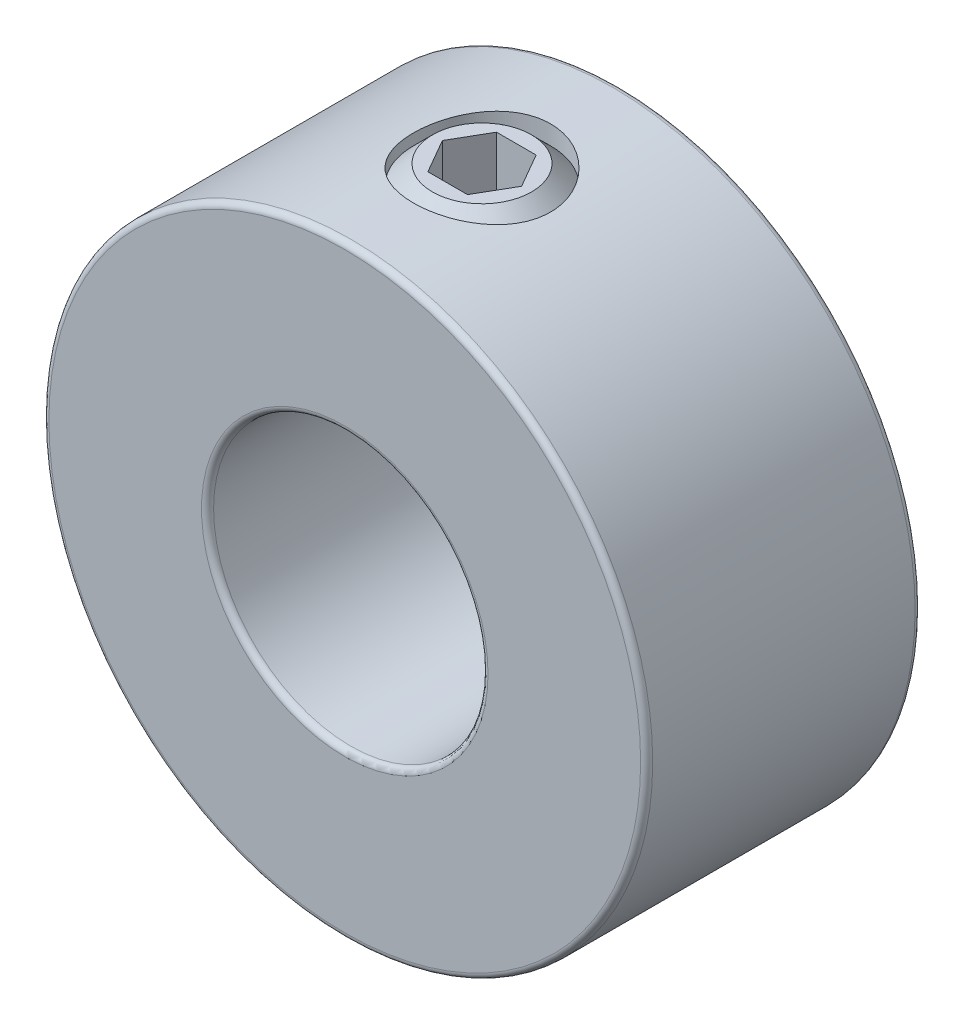
ISO-10303-21;
HEADER;
FILE_DESCRIPTION(('STEP AP214'),'2;1');
FILE_NAME('part.step','',(''),(''),'','','');
FILE_SCHEMA(('AUTOMOTIVE_DESIGN { 1 0 10303 214 1 1 1 1 }'));
ENDSEC;
DATA;
#1=APPLICATION_CONTEXT('core data for automotive mechanical design processes');
#2=APPLICATION_PROTOCOL_DEFINITION('international standard','automotive_design',2000,#1);
#3=PRODUCT_CONTEXT('',#1,'mechanical');
#4=PRODUCT('Part','Part','',(#3));
#5=PRODUCT_RELATED_PRODUCT_CATEGORY('part','',(#4));
#6=PRODUCT_DEFINITION_FORMATION('','',#4);
#7=PRODUCT_DEFINITION_CONTEXT('part definition',#1,'design');
#8=PRODUCT_DEFINITION('design','',#6,#7);
#9=PRODUCT_DEFINITION_SHAPE('','',#8);
#10=(LENGTH_UNIT() NAMED_UNIT(*) SI_UNIT(.MILLI.,.METRE.));
#11=(NAMED_UNIT(*) PLANE_ANGLE_UNIT() SI_UNIT($,.RADIAN.));
#12=(NAMED_UNIT(*) SI_UNIT($,.STERADIAN.) SOLID_ANGLE_UNIT());
#13=UNCERTAINTY_MEASURE_WITH_UNIT(LENGTH_MEASURE(1.E-05),#10,'distance_accuracy_value','');
#14=(GEOMETRIC_REPRESENTATION_CONTEXT(3) GLOBAL_UNCERTAINTY_ASSIGNED_CONTEXT((#13)) GLOBAL_UNIT_ASSIGNED_CONTEXT((#10,
#11,#12)) REPRESENTATION_CONTEXT('',''));
#15=CARTESIAN_POINT('',(0.,0.,0.));
#16=DIRECTION('',(0.,0.,1.));
#17=DIRECTION('',(1.,0.,0.));
#18=AXIS2_PLACEMENT_3D('',#15,#16,#17);
#19=CARTESIAN_POINT('',(0.,6.69578040878242,5.));
#20=DIRECTION('',(0.,1.,0.));
#21=DIRECTION('',(-1.,0.,0.));
#22=AXIS2_PLACEMENT_3D('',#19,#20,#21);
#23=CONICAL_SURFACE('',#22,2.5,0.785398163397447);
#24=CARTESIAN_POINT('',(0.,6.,5.));
#25=DIRECTION('',(0.,-1.,0.));
#26=DIRECTION('',(1.,0.,0.));
#27=AXIS2_PLACEMENT_3D('',#24,#25,#26);
#28=CIRCLE('',#27,1.80421959121758);
#29=CARTESIAN_POINT('',(1.80421959121758,6.,5.));
#30=VERTEX_POINT('',#29);
#31=EDGE_CURVE('E12',#30,#30,#28,.T.);
#32=ORIENTED_EDGE('',*,*,#31,.F.);
#33=EDGE_LOOP('',(#32));
#34=FACE_BOUND('',#33,.T.);
#35=CARTESIAN_POINT('',(0.,6.69578040878242,5.));
#36=DIRECTION('',(0.,-1.,0.));
#37=DIRECTION('',(1.,0.,0.));
#38=AXIS2_PLACEMENT_3D('',#35,#36,#37);
#39=CIRCLE('',#38,2.5);
#40=CARTESIAN_POINT('',(2.5,6.69578040878242,5.));
#41=VERTEX_POINT('',#40);
#42=EDGE_CURVE('E146',#41,#41,#39,.T.);
#43=ORIENTED_EDGE('',*,*,#42,.T.);
#44=EDGE_LOOP('',(#43));
#45=FACE_BOUND('',#44,.T.);
#46=ADVANCED_FACE('F47',(#34,#45),#23,.T.);
#47=CARTESIAN_POINT('',(-0.625,6.,5.));
#48=DIRECTION('',(0.,1.,0.));
#49=DIRECTION('',(-1.,0.,0.));
#50=AXIS2_PLACEMENT_3D('',#47,#48,#49);
#51=PLANE('',#50);
#52=CARTESIAN_POINT('',(0.,6.,5.));
#53=DIRECTION('',(0.,-1.,0.));
#54=DIRECTION('',(1.,0.,0.));
#55=AXIS2_PLACEMENT_3D('',#52,#53,#54);
#56=CIRCLE('',#55,0.625);
#57=CARTESIAN_POINT('',(0.625,6.,5.));
#58=VERTEX_POINT('',#57);
#59=EDGE_CURVE('E54',#58,#58,#56,.T.);
#60=ORIENTED_EDGE('',*,*,#59,.F.);
#61=EDGE_LOOP('',(#60));
#62=FACE_BOUND('',#61,.T.);
#63=ORIENTED_EDGE('',*,*,#31,.T.);
#64=EDGE_LOOP('',(#63));
#65=FACE_BOUND('',#64,.T.);
#66=ADVANCED_FACE('F166',(#62,#65),#51,.F.);
#67=CARTESIAN_POINT('',(0.,6.,5.));
#68=DIRECTION('',(0.,-1.,0.));
#69=DIRECTION('',(1.,0.,0.));
#70=AXIS2_PLACEMENT_3D('',#67,#68,#69);
#71=CONICAL_SURFACE('',#70,0.625,0.523598775598296);
#72=CARTESIAN_POINT('',(0.,7.08253175473055,5.));
#73=VERTEX_POINT('',#72);
#74=VERTEX_LOOP('',#73);
#75=FACE_BOUND('',#74,.T.);
#76=ORIENTED_EDGE('',*,*,#59,.T.);
#77=EDGE_LOOP('',(#76));
#78=FACE_BOUND('',#77,.T.);
#79=ADVANCED_FACE('F164',(#75,#78),#71,.F.);
#80=CARTESIAN_POINT('',(0.,11.,5.));
#81=DIRECTION('',(0.,-1.,0.));
#82=DIRECTION('',(1.,0.,0.));
#83=AXIS2_PLACEMENT_3D('',#80,#81,#82);
#84=PLANE('',#83);
#85=DIRECTION('',(0.5,0.,0.866025403784439));
#86=VECTOR('',#85,1.);
#87=CARTESIAN_POINT('',(-1.44337567297406,11.,5.));
#88=LINE('',#87,#86);
#89=CARTESIAN_POINT('',(-1.44337567297406,11.,5.));
#90=VERTEX_POINT('',#89);
#91=CARTESIAN_POINT('',(-0.721687836487028,11.,6.25));
#92=VERTEX_POINT('',#91);
#93=EDGE_CURVE('E134',#90,#92,#88,.T.);
#94=ORIENTED_EDGE('',*,*,#93,.F.);
#95=DIRECTION('',(-0.499999999999999,0.,0.866025403784439));
#96=VECTOR('',#95,1.);
#97=CARTESIAN_POINT('',(-0.721687836487029,11.,3.75));
#98=LINE('',#97,#96);
#99=CARTESIAN_POINT('',(-0.721687836487029,11.,3.75));
#100=VERTEX_POINT('',#99);
#101=EDGE_CURVE('E61',#100,#90,#98,.T.);
#102=ORIENTED_EDGE('',*,*,#101,.F.);
#103=DIRECTION('',(-1.,0.,0.));
#104=VECTOR('',#103,1.);
#105=CARTESIAN_POINT('',(0.721687836487035,11.,3.75));
#106=LINE('',#105,#104);
#107=CARTESIAN_POINT('',(0.721687836487035,11.,3.75));
#108=VERTEX_POINT('',#107);
#109=EDGE_CURVE('E120',#108,#100,#106,.T.);
#110=ORIENTED_EDGE('',*,*,#109,.F.);
#111=DIRECTION('',(-0.5,0.,-0.866025403784439));
#112=VECTOR('',#111,1.);
#113=CARTESIAN_POINT('',(1.44337567297407,11.,5.));
#114=LINE('',#113,#112);
#115=CARTESIAN_POINT('',(1.44337567297407,11.,5.));
#116=VERTEX_POINT('',#115);
#117=EDGE_CURVE('E123',#116,#108,#114,.T.);
#118=ORIENTED_EDGE('',*,*,#117,.F.);
#119=DIRECTION('',(0.499999999999999,0.,-0.866025403784439));
#120=VECTOR('',#119,1.);
#121=CARTESIAN_POINT('',(0.721687836487035,11.,6.25));
#122=LINE('',#121,#120);
#123=CARTESIAN_POINT('',(0.721687836487035,11.,6.25));
#124=VERTEX_POINT('',#123);
#125=EDGE_CURVE('E139',#124,#116,#122,.T.);
#126=ORIENTED_EDGE('',*,*,#125,.F.);
#127=DIRECTION('',(1.,0.,0.));
#128=VECTOR('',#127,1.);
#129=CARTESIAN_POINT('',(-0.721687836487028,11.,6.25));
#130=LINE('',#129,#128);
#131=EDGE_CURVE('E136',#92,#124,#130,.T.);
#132=ORIENTED_EDGE('',*,*,#131,.F.);
#133=EDGE_LOOP('',(#94,#102,#110,#118,#126,#132));
#134=FACE_BOUND('',#133,.T.);
#135=CARTESIAN_POINT('',(0.,11.,5.));
#136=DIRECTION('',(0.,-1.,0.));
#137=DIRECTION('',(1.,0.,0.));
#138=AXIS2_PLACEMENT_3D('',#135,#136,#137);
#139=CIRCLE('',#138,1.80421959121758);
#140=CARTESIAN_POINT('',(1.80421959121758,11.,5.));
#141=VERTEX_POINT('',#140);
#142=EDGE_CURVE('E159',#141,#141,#139,.T.);
#143=ORIENTED_EDGE('',*,*,#142,.F.);
#144=EDGE_LOOP('',(#143));
#145=FACE_BOUND('',#144,.T.);
#146=ADVANCED_FACE('F184',(#134,#145),#84,.F.);
#147=CARTESIAN_POINT('',(0.,11.,5.));
#148=DIRECTION('',(0.,-1.,0.));
#149=DIRECTION('',(1.,0.,0.));
#150=AXIS2_PLACEMENT_3D('',#147,#148,#149);
#151=CONICAL_SURFACE('',#150,1.80421959121758,0.785398163397446);
#152=CARTESIAN_POINT('',(0.,10.3042195912176,5.));
#153=DIRECTION('',(0.,-1.,0.));
#154=DIRECTION('',(1.,0.,0.));
#155=AXIS2_PLACEMENT_3D('',#152,#153,#154);
#156=CIRCLE('',#155,2.5);
#157=CARTESIAN_POINT('',(2.5,10.3042195912176,5.));
#158=VERTEX_POINT('',#157);
#159=EDGE_CURVE('E156',#158,#158,#156,.T.);
#160=ORIENTED_EDGE('',*,*,#159,.F.);
#161=EDGE_LOOP('',(#160));
#162=FACE_BOUND('',#161,.T.);
#163=ORIENTED_EDGE('',*,*,#142,.T.);
#164=EDGE_LOOP('',(#163));
#165=FACE_BOUND('',#164,.T.);
#166=ADVANCED_FACE('F178',(#162,#165),#151,.T.);
#167=CARTESIAN_POINT('',(0.,7.08253175473055,5.));
#168=DIRECTION('',(0.,-1.,0.));
#169=DIRECTION('',(1.,0.,0.));
#170=AXIS2_PLACEMENT_3D('',#167,#168,#169);
#171=CYLINDRICAL_SURFACE('',#170,2.5);
#172=ORIENTED_EDGE('',*,*,#42,.F.);
#173=EDGE_LOOP('',(#172));
#174=FACE_BOUND('',#173,.T.);
#175=ORIENTED_EDGE('',*,*,#159,.T.);
#176=EDGE_LOOP('',(#175));
#177=FACE_BOUND('',#176,.T.);
#178=ADVANCED_FACE('F175',(#174,#177),#171,.T.);
#179=CARTESIAN_POINT('',(-0.721687836487029,9.,3.75));
#180=DIRECTION('',(-0.866025403784439,0.,-0.499999999999999));
#181=DIRECTION('',(-0.499999999999999,0.,0.866025403784439));
#182=AXIS2_PLACEMENT_3D('',#179,#180,#181);
#183=PLANE('',#182);
#184=ORIENTED_EDGE('',*,*,#101,.T.);
#185=DIRECTION('',(0.,1.,0.));
#186=VECTOR('',#185,1.);
#187=CARTESIAN_POINT('',(-1.44337567297406,9.,5.));
#188=LINE('',#187,#186);
#189=CARTESIAN_POINT('',(-1.44337567297406,9.,5.));
#190=VERTEX_POINT('',#189);
#191=EDGE_CURVE('E97',#190,#90,#188,.T.);
#192=ORIENTED_EDGE('',*,*,#191,.F.);
#193=DIRECTION('',(-0.499999999999999,0.,0.866025403784439));
#194=VECTOR('',#193,1.);
#195=CARTESIAN_POINT('',(-0.721687836487029,9.,3.75));
#196=LINE('',#195,#194);
#197=CARTESIAN_POINT('',(-0.721687836487029,9.,3.75));
#198=VERTEX_POINT('',#197);
#199=EDGE_CURVE('E101',#198,#190,#196,.T.);
#200=ORIENTED_EDGE('',*,*,#199,.F.);
#201=DIRECTION('',(0.,1.,0.));
#202=VECTOR('',#201,1.);
#203=CARTESIAN_POINT('',(-0.721687836487029,9.,3.75));
#204=LINE('',#203,#202);
#205=EDGE_CURVE('E144',#198,#100,#204,.T.);
#206=ORIENTED_EDGE('',*,*,#205,.T.);
#207=EDGE_LOOP('',(#184,#192,#200,#206));
#208=FACE_BOUND('',#207,.T.);
#209=ADVANCED_FACE('F99',(#208),#183,.F.);
#210=CARTESIAN_POINT('',(0.721687836487036,9.,3.75));
#211=DIRECTION('',(0.,0.,-1.));
#212=DIRECTION('',(-1.,0.,0.));
#213=AXIS2_PLACEMENT_3D('',#210,#211,#212);
#214=PLANE('',#213);
#215=ORIENTED_EDGE('',*,*,#109,.T.);
#216=ORIENTED_EDGE('',*,*,#205,.F.);
#217=DIRECTION('',(-1.,0.,0.));
#218=VECTOR('',#217,1.);
#219=CARTESIAN_POINT('',(0.721687836487036,9.,3.75));
#220=LINE('',#219,#218);
#221=CARTESIAN_POINT('',(0.721687836487036,9.,3.75));
#222=VERTEX_POINT('',#221);
#223=EDGE_CURVE('E107',#222,#198,#220,.T.);
#224=ORIENTED_EDGE('',*,*,#223,.F.);
#225=DIRECTION('',(0.,1.,0.));
#226=VECTOR('',#225,1.);
#227=CARTESIAN_POINT('',(0.721687836487036,9.,3.75));
#228=LINE('',#227,#226);
#229=EDGE_CURVE('E147',#222,#108,#228,.T.);
#230=ORIENTED_EDGE('',*,*,#229,.T.);
#231=EDGE_LOOP('',(#215,#216,#224,#230));
#232=FACE_BOUND('',#231,.T.);
#233=ADVANCED_FACE('F198',(#232),#214,.F.);
#234=CARTESIAN_POINT('',(1.44337567297407,9.,5.));
#235=DIRECTION('',(0.866025403784439,0.,-0.5));
#236=DIRECTION('',(-0.5,0.,-0.866025403784439));
#237=AXIS2_PLACEMENT_3D('',#234,#235,#236);
#238=PLANE('',#237);
#239=ORIENTED_EDGE('',*,*,#117,.T.);
#240=ORIENTED_EDGE('',*,*,#229,.F.);
#241=DIRECTION('',(-0.5,0.,-0.866025403784439));
#242=VECTOR('',#241,1.);
#243=CARTESIAN_POINT('',(1.44337567297407,9.,5.));
#244=LINE('',#243,#242);
#245=CARTESIAN_POINT('',(1.44337567297407,9.,5.));
#246=VERTEX_POINT('',#245);
#247=EDGE_CURVE('E130',#246,#222,#244,.T.);
#248=ORIENTED_EDGE('',*,*,#247,.F.);
#249=DIRECTION('',(0.,1.,0.));
#250=VECTOR('',#249,1.);
#251=CARTESIAN_POINT('',(1.44337567297407,9.,5.));
#252=LINE('',#251,#250);
#253=EDGE_CURVE('E149',#246,#116,#252,.T.);
#254=ORIENTED_EDGE('',*,*,#253,.T.);
#255=EDGE_LOOP('',(#239,#240,#248,#254));
#256=FACE_BOUND('',#255,.T.);
#257=ADVANCED_FACE('F208',(#256),#238,.F.);
#258=CARTESIAN_POINT('',(0.721687836487036,9.,6.25));
#259=DIRECTION('',(0.866025403784439,0.,0.499999999999999));
#260=DIRECTION('',(0.499999999999999,0.,-0.866025403784439));
#261=AXIS2_PLACEMENT_3D('',#258,#259,#260);
#262=PLANE('',#261);
#263=ORIENTED_EDGE('',*,*,#125,.T.);
#264=ORIENTED_EDGE('',*,*,#253,.F.);
#265=DIRECTION('',(0.499999999999999,0.,-0.866025403784439));
#266=VECTOR('',#265,1.);
#267=CARTESIAN_POINT('',(0.721687836487036,9.,6.25));
#268=LINE('',#267,#266);
#269=CARTESIAN_POINT('',(0.721687836487036,9.,6.25));
#270=VERTEX_POINT('',#269);
#271=EDGE_CURVE('E127',#270,#246,#268,.T.);
#272=ORIENTED_EDGE('',*,*,#271,.F.);
#273=DIRECTION('',(0.,1.,0.));
#274=VECTOR('',#273,1.);
#275=CARTESIAN_POINT('',(0.721687836487036,9.,6.25));
#276=LINE('',#275,#274);
#277=EDGE_CURVE('E151',#270,#124,#276,.T.);
#278=ORIENTED_EDGE('',*,*,#277,.T.);
#279=EDGE_LOOP('',(#263,#264,#272,#278));
#280=FACE_BOUND('',#279,.T.);
#281=ADVANCED_FACE('F204',(#280),#262,.F.);
#282=CARTESIAN_POINT('',(-0.721687836487028,9.,6.25));
#283=DIRECTION('',(0.,0.,1.));
#284=DIRECTION('',(1.,0.,0.));
#285=AXIS2_PLACEMENT_3D('',#282,#283,#284);
#286=PLANE('',#285);
#287=ORIENTED_EDGE('',*,*,#131,.T.);
#288=ORIENTED_EDGE('',*,*,#277,.F.);
#289=DIRECTION('',(1.,0.,0.));
#290=VECTOR('',#289,1.);
#291=CARTESIAN_POINT('',(-0.721687836487028,9.,6.25));
#292=LINE('',#291,#290);
#293=CARTESIAN_POINT('',(-0.721687836487028,9.,6.25));
#294=VERTEX_POINT('',#293);
#295=EDGE_CURVE('E115',#294,#270,#292,.T.);
#296=ORIENTED_EDGE('',*,*,#295,.F.);
#297=DIRECTION('',(0.,1.,0.));
#298=VECTOR('',#297,1.);
#299=CARTESIAN_POINT('',(-0.721687836487028,9.,6.25));
#300=LINE('',#299,#298);
#301=EDGE_CURVE('E106',#294,#92,#300,.T.);
#302=ORIENTED_EDGE('',*,*,#301,.T.);
#303=EDGE_LOOP('',(#287,#288,#296,#302));
#304=FACE_BOUND('',#303,.T.);
#305=ADVANCED_FACE('F201',(#304),#286,.F.);
#306=CARTESIAN_POINT('',(-1.44337567297406,9.,5.));
#307=DIRECTION('',(-0.866025403784439,0.,0.5));
#308=DIRECTION('',(0.5,0.,0.866025403784439));
#309=AXIS2_PLACEMENT_3D('',#306,#307,#308);
#310=PLANE('',#309);
#311=ORIENTED_EDGE('',*,*,#93,.T.);
#312=ORIENTED_EDGE('',*,*,#301,.F.);
#313=DIRECTION('',(0.5,0.,0.866025403784439));
#314=VECTOR('',#313,1.);
#315=CARTESIAN_POINT('',(-1.44337567297406,9.,5.));
#316=LINE('',#315,#314);
#317=EDGE_CURVE('E110',#190,#294,#316,.T.);
#318=ORIENTED_EDGE('',*,*,#317,.F.);
#319=ORIENTED_EDGE('',*,*,#191,.T.);
#320=EDGE_LOOP('',(#311,#312,#318,#319));
#321=FACE_BOUND('',#320,.T.);
#322=ADVANCED_FACE('F111',(#321),#310,.F.);
#323=CARTESIAN_POINT('',(-2.16506350946109,9.,6.25));
#324=DIRECTION('',(0.,1.,0.));
#325=DIRECTION('',(0.,0.,1.));
#326=AXIS2_PLACEMENT_3D('',#323,#324,#325);
#327=PLANE('',#326);
#328=ORIENTED_EDGE('',*,*,#199,.T.);
#329=ORIENTED_EDGE('',*,*,#317,.T.);
#330=ORIENTED_EDGE('',*,*,#295,.T.);
#331=ORIENTED_EDGE('',*,*,#271,.T.);
#332=ORIENTED_EDGE('',*,*,#247,.T.);
#333=ORIENTED_EDGE('',*,*,#223,.T.);
#334=EDGE_LOOP('',(#328,#329,#330,#331,#332,#333));
#335=FACE_BOUND('',#334,.T.);
#336=ADVANCED_FACE('F117',(#335),#327,.T.);
#337=CLOSED_SHELL('',(#46,#66,#79,#146,#166,#178,#209,#233,#257,#281,#305,#322,#336));
#338=MANIFOLD_SOLID_BREP('B2',#337);
#339=CARTESIAN_POINT('',(0.,0.,10.));
#340=DIRECTION('',(0.,0.,1.));
#341=DIRECTION('',(1.,0.,0.));
#342=AXIS2_PLACEMENT_3D('',#339,#340,#341);
#343=PLANE('',#342);
#344=CARTESIAN_POINT('',(0.,0.,10.));
#345=DIRECTION('',(0.,0.,1.));
#346=DIRECTION('',(1.,0.,0.));
#347=AXIS2_PLACEMENT_3D('',#344,#345,#346);
#348=CIRCLE('',#347,5.22);
#349=CARTESIAN_POINT('',(5.22,0.,10.));
#350=VERTEX_POINT('',#349);
#351=EDGE_CURVE('E315',#350,#350,#348,.F.);
#352=ORIENTED_EDGE('',*,*,#351,.T.);
#353=EDGE_LOOP('',(#352));
#354=FACE_BOUND('',#353,.T.);
#355=CARTESIAN_POINT('',(0.,0.,10.));
#356=DIRECTION('',(0.,0.,1.));
#357=DIRECTION('',(1.,0.,0.));
#358=AXIS2_PLACEMENT_3D('',#355,#356,#357);
#359=CIRCLE('',#358,10.78);
#360=CARTESIAN_POINT('',(10.78,0.,10.));
#361=VERTEX_POINT('',#360);
#362=EDGE_CURVE('E319',#361,#361,#359,.T.);
#363=ORIENTED_EDGE('',*,*,#362,.T.);
#364=EDGE_LOOP('',(#363));
#365=FACE_BOUND('',#364,.T.);
#366=ADVANCED_FACE('F304',(#354,#365),#343,.T.);
#367=CARTESIAN_POINT('',(0.,0.,0.));
#368=DIRECTION('',(0.,0.,1.));
#369=DIRECTION('',(1.,0.,0.));
#370=AXIS2_PLACEMENT_3D('',#367,#368,#369);
#371=PLANE('',#370);
#372=CARTESIAN_POINT('',(0.,0.,0.));
#373=DIRECTION('',(0.,0.,1.));
#374=DIRECTION('',(1.,0.,0.));
#375=AXIS2_PLACEMENT_3D('',#372,#373,#374);
#376=CIRCLE('',#375,5.22);
#377=CARTESIAN_POINT('',(5.22,0.,0.));
#378=VERTEX_POINT('',#377);
#379=EDGE_CURVE('E330',#378,#378,#376,.T.);
#380=ORIENTED_EDGE('',*,*,#379,.T.);
#381=EDGE_LOOP('',(#380));
#382=FACE_BOUND('',#381,.T.);
#383=CARTESIAN_POINT('',(0.,0.,0.));
#384=DIRECTION('',(0.,0.,1.));
#385=DIRECTION('',(1.,0.,0.));
#386=AXIS2_PLACEMENT_3D('',#383,#384,#385);
#387=CIRCLE('',#386,10.78);
#388=CARTESIAN_POINT('',(10.78,0.,0.));
#389=VERTEX_POINT('',#388);
#390=EDGE_CURVE('E333',#389,#389,#387,.F.);
#391=ORIENTED_EDGE('',*,*,#390,.T.);
#392=EDGE_LOOP('',(#391));
#393=FACE_BOUND('',#392,.T.);
#394=ADVANCED_FACE('F367',(#382,#393),#371,.F.);
#395=CARTESIAN_POINT('',(0.,0.,10.));
#396=DIRECTION('',(0.,0.,-1.));
#397=DIRECTION('',(-1.,0.,0.));
#398=AXIS2_PLACEMENT_3D('',#395,#396,#397);
#399=CYLINDRICAL_SURFACE('',#398,11.);
#400=CARTESIAN_POINT('',(0.,0.,0.22));
#401=DIRECTION('',(0.,0.,1.));
#402=DIRECTION('',(1.,0.,0.));
#403=AXIS2_PLACEMENT_3D('',#400,#401,#402);
#404=CIRCLE('',#403,11.);
#405=CARTESIAN_POINT('',(11.,0.,0.22));
#406=VERTEX_POINT('',#405);
#407=EDGE_CURVE('E46',#406,#406,#404,.T.);
#408=ORIENTED_EDGE('',*,*,#407,.T.);
#409=EDGE_LOOP('',(#408));
#410=FACE_BOUND('',#409,.T.);
#411=CARTESIAN_POINT('',(0.,0.,9.78));
#412=DIRECTION('',(0.,0.,1.));
#413=DIRECTION('',(1.,0.,0.));
#414=AXIS2_PLACEMENT_3D('',#411,#412,#413);
#415=CIRCLE('',#414,11.);
#416=CARTESIAN_POINT('',(11.,0.,9.78));
#417=VERTEX_POINT('',#416);
#418=EDGE_CURVE('E311',#417,#417,#415,.F.);
#419=ORIENTED_EDGE('',*,*,#418,.T.);
#420=EDGE_LOOP('',(#419));
#421=FACE_BOUND('',#420,.T.);
#422=CARTESIAN_POINT('',(0.,11.,7.5));
#423=CARTESIAN_POINT('',(-0.138518278596904,10.9999974735185,7.49999546817359));
#424=CARTESIAN_POINT('',(-0.277090172258008,10.9973570934613,7.48844877242309));
#425=CARTESIAN_POINT('',(-0.550288594599323,10.987079320306,7.44262052393831));
#426=CARTESIAN_POINT('',(-0.68491239222073,10.9794385496265,7.40832360404474));
#427=CARTESIAN_POINT('',(-0.946227671984915,10.9600095312294,7.31813195136811));
#428=CARTESIAN_POINT('',(-1.07292759495647,10.9482257885674,7.26226067201927));
#429=CARTESIAN_POINT('',(-1.31515227582566,10.921778201627,7.13058288661913));
#430=CARTESIAN_POINT('',(-1.43067714503182,10.9071143860398,7.05477657915759));
#431=CARTESIAN_POINT('',(-1.64926760444638,10.8762265816814,6.88399795539333));
#432=CARTESIAN_POINT('',(-1.75211293892049,10.8599819758326,6.788747426525));
#433=CARTESIAN_POINT('',(-1.9405138981661,10.827906511833,6.58238102586276));
#434=CARTESIAN_POINT('',(-2.02606788121784,10.8120756930933,6.47126364930555));
#435=CARTESIAN_POINT('',(-2.17844599401787,10.7824158369221,6.23466794471632));
#436=CARTESIAN_POINT('',(-2.24503254356575,10.7686131580577,6.10903300369417));
#437=CARTESIAN_POINT('',(-2.3560606971787,10.7448696147509,5.84799049941838));
#438=CARTESIAN_POINT('',(-2.40050517717749,10.7349282488168,5.71258420793838));
#439=CARTESIAN_POINT('',(-2.46525349412718,10.7202434469831,5.43824081288346));
#440=CARTESIAN_POINT('',(-2.48594892680754,10.715415797339,5.29940073687746));
#441=CARTESIAN_POINT('',(-2.50382988451487,10.7112523406768,5.02014177278689));
#442=CARTESIAN_POINT('',(-2.50101853886552,10.711915802658,4.87972309733773));
#443=CARTESIAN_POINT('',(-2.47228016958762,10.7185835035919,4.6042271166513));
#444=CARTESIAN_POINT('',(-2.44681104599438,10.7244819412976,4.46909909380509));
#445=CARTESIAN_POINT('',(-2.37420684920502,10.7407873672743,4.20508551384518));
#446=CARTESIAN_POINT('',(-2.32707047404288,10.7511946264744,4.07620033237282));
#447=CARTESIAN_POINT('',(-2.21205734402544,10.7754474384537,3.82705932818947));
#448=CARTESIAN_POINT('',(-2.14400712086008,10.7893215597825,3.70688648223631));
#449=CARTESIAN_POINT('',(-1.98921977920408,10.8189276843241,3.47949744688894));
#450=CARTESIAN_POINT('',(-1.90247992237134,10.8346599596346,3.37228315973606));
#451=CARTESIAN_POINT('',(-1.71036518003517,10.8666615287251,3.17122143817898));
#452=CARTESIAN_POINT('',(-1.60460166742828,10.882934773515,3.07774557348365));
#453=CARTESIAN_POINT('',(-1.37871229840972,10.9138502597158,2.90979411129289));
#454=CARTESIAN_POINT('',(-1.2585861400908,10.9284924668293,2.83531891330053));
#455=CARTESIAN_POINT('',(-1.00690799179916,10.9545497424637,2.7073796120285));
#456=CARTESIAN_POINT('',(-0.875328834348159,10.9659568484873,2.65396722637767));
#457=CARTESIAN_POINT('',(-0.604745122491699,10.9841998956698,2.57011599413208));
#458=CARTESIAN_POINT('',(-0.465741739663721,10.9910365557784,2.53967353417782));
#459=CARTESIAN_POINT('',(-0.187439840192734,10.9992650071756,2.50317376252731));
#460=CARTESIAN_POINT('',(-0.0482110923370393,11.0007700184113,2.49660930868326));
#461=CARTESIAN_POINT('',(0.229353886680103,10.9984842255063,2.50667303985293));
#462=CARTESIAN_POINT('',(0.367690182720858,10.9946938107912,2.52329951940597));
#463=CARTESIAN_POINT('',(0.637841677218458,10.9823148103741,2.57885316690542));
#464=CARTESIAN_POINT('',(0.769715036814425,10.973784087055,2.61751154644373));
#465=CARTESIAN_POINT('',(1.0251039308776,10.9528806132367,2.71573102745708));
#466=CARTESIAN_POINT('',(1.14861871432289,10.9405075180554,2.77529400425326));
#467=CARTESIAN_POINT('',(1.38586085256056,10.9130143275095,2.91466914355534));
#468=CARTESIAN_POINT('',(1.49941068522719,10.8978552985532,2.99477562677316));
#469=CARTESIAN_POINT('',(1.71163773579052,10.866546095646,3.17257932844021));
#470=CARTESIAN_POINT('',(1.8103128535797,10.8503957821912,3.27027902654684));
#471=CARTESIAN_POINT('',(1.99201706218096,10.8185287714487,3.48283096513342));
#472=CARTESIAN_POINT('',(2.07469366594062,10.8028272119253,3.59798724178681));
#473=CARTESIAN_POINT('',(2.21953814406553,10.7740023321604,3.84084639067028));
#474=CARTESIAN_POINT('',(2.28170692501017,10.7608788979592,3.96854870795962));
#475=CARTESIAN_POINT('',(2.38333597241928,10.7388274870674,4.23218046956891));
#476=CARTESIAN_POINT('',(2.42292716221704,10.7298753781702,4.36805732374335));
#477=CARTESIAN_POINT('',(2.47865258340365,10.7171411058581,4.64476690669912));
#478=CARTESIAN_POINT('',(2.49479091341614,10.7133580391079,4.7855987651364));
#479=CARTESIAN_POINT('',(2.50296739214165,10.7114502943222,5.06465861931089));
#480=CARTESIAN_POINT('',(2.49556548501071,10.7131941458177,5.2028695993336));
#481=CARTESIAN_POINT('',(2.45813115403283,10.7218446846914,5.47601891018826));
#482=CARTESIAN_POINT('',(2.42809904217009,10.7287513008948,5.61095728611047));
#483=CARTESIAN_POINT('',(2.34653692360609,10.7468826027048,5.87324339736628));
#484=CARTESIAN_POINT('',(2.29509457527995,10.758089666867,6.0006196911415));
#485=CARTESIAN_POINT('',(2.1722453660688,10.783564723281,6.24501470690061));
#486=CARTESIAN_POINT('',(2.10083623731223,10.7978330631966,6.36203225032551));
#487=CARTESIAN_POINT('',(1.93824996891049,10.828211072634,6.58513442765527));
#488=CARTESIAN_POINT('',(1.84667645642834,10.8443540558786,6.69092572220738));
#489=CARTESIAN_POINT('',(1.64715628932417,10.8764454859305,6.88582318508195));
#490=CARTESIAN_POINT('',(1.53920583540675,10.8923938866665,6.97492547096597));
#491=CARTESIAN_POINT('',(1.30814060515056,10.9225693389041,7.13513806023372));
#492=CARTESIAN_POINT('',(1.1848316218762,10.9367686161711,7.20597382333314));
#493=CARTESIAN_POINT('',(0.927755967711687,10.9615640551399,7.32579997066296));
#494=CARTESIAN_POINT('',(0.793997844337693,10.9721631246672,7.37480799478667));
#495=CARTESIAN_POINT('',(0.55016307153962,10.9867559512784,7.44122790617612));
#496=CARTESIAN_POINT('',(0.441368111138488,10.9916908558499,7.4632239876893));
#497=CARTESIAN_POINT('',(0.221726814930916,10.9983138080738,7.49261147357934));
#498=CARTESIAN_POINT('',(0.110880584717101,11.0000020223883,7.50000362761917));
#499=CARTESIAN_POINT('',(0.,11.,7.5));
#500=B_SPLINE_CURVE_WITH_KNOTS('',3,(#422,#423,#424,#425,#426,#427,#428,#429,#430,#431,#432,
#433,#434,#435,#436,#437,#438,#439,#440,#441,#442,#443,#444,#445,#446,#447,#448,#449,#450,#451,
#452,#453,#454,#455,#456,#457,#458,#459,#460,#461,#462,#463,#464,#465,#466,#467,#468,#469,#470,
#471,#472,#473,#474,#475,#476,#477,#478,#479,#480,#481,#482,#483,#484,#485,#486,#487,#488,#489,
#490,#491,#492,#493,#494,#495,#496,#497,#498,#499),.UNSPECIFIED.,.T.,.F.,(4,2,2,2,2,2,2,2,2,2,2,
2,2,2,2,2,2,2,2,2,2,2,2,2,2,2,2,2,2,2,2,2,2,2,2,2,2,2,4),(0.,0.415148849633315,
0.830578406996928,1.24555761755318,1.66053269430525,2.08192389396808,2.50335508365802,
2.92985362973414,3.35629676538239,3.77560244898082,4.19485231368757,4.60581714174235,
5.01680666753971,5.4313015743885,5.84585725297978,6.27011531803703,6.69438230269862,
7.11968464096647,7.54492006169895,7.96106941916761,8.37718817463627,8.78833576149036,
9.19952024123083,9.61696129328767,10.0344612272567,10.460313215404,10.8861463755948,
11.3094844190899,11.732748471094,12.1460204395145,12.5592867105953,12.9708773657615,
13.382514789318,13.8031102578591,14.2238034502007,14.6504927745347,15.0768366452215,
15.4091704772436,15.74148724914),.UNSPECIFIED.);
#501=CARTESIAN_POINT('',(0.,11.,7.5));
#502=VERTEX_POINT('',#501);
#503=EDGE_CURVE('E336',#502,#502,#500,.T.);
#504=ORIENTED_EDGE('',*,*,#503,.T.);
#505=EDGE_LOOP('',(#504));
#506=FACE_BOUND('',#505,.T.);
#507=ADVANCED_FACE('F363',(#410,#421,#506),#399,.T.);
#508=CARTESIAN_POINT('',(0.,0.,10.));
#509=DIRECTION('',(0.,0.,-1.));
#510=DIRECTION('',(-1.,0.,0.));
#511=AXIS2_PLACEMENT_3D('',#508,#509,#510);
#512=CYLINDRICAL_SURFACE('',#511,5.);
#513=CARTESIAN_POINT('',(0.,0.,0.22));
#514=DIRECTION('',(0.,0.,1.));
#515=DIRECTION('',(1.,0.,0.));
#516=AXIS2_PLACEMENT_3D('',#513,#514,#515);
#517=CIRCLE('',#516,5.);
#518=CARTESIAN_POINT('',(5.,0.,0.22));
#519=VERTEX_POINT('',#518);
#520=EDGE_CURVE('E324',#519,#519,#517,.F.);
#521=ORIENTED_EDGE('',*,*,#520,.T.);
#522=EDGE_LOOP('',(#521));
#523=FACE_BOUND('',#522,.T.);
#524=CARTESIAN_POINT('',(0.,0.,9.78));
#525=DIRECTION('',(0.,0.,1.));
#526=DIRECTION('',(1.,0.,0.));
#527=AXIS2_PLACEMENT_3D('',#524,#525,#526);
#528=CIRCLE('',#527,5.);
#529=CARTESIAN_POINT('',(5.,0.,9.78));
#530=VERTEX_POINT('',#529);
#531=EDGE_CURVE('E327',#530,#530,#528,.T.);
#532=ORIENTED_EDGE('',*,*,#531,.T.);
#533=EDGE_LOOP('',(#532));
#534=FACE_BOUND('',#533,.T.);
#535=CARTESIAN_POINT('',(0.,5.,7.5));
#536=CARTESIAN_POINT('',(-0.131426682334305,4.99999177550472,7.49999033094399));
#537=CARTESIAN_POINT('',(-0.263015634437213,4.99476199135277,7.48957443822597));
#538=CARTESIAN_POINT('',(-0.522301454622883,4.9743541856102,7.44836817883795));
#539=CARTESIAN_POINT('',(-0.649990448564105,4.9591572718767,7.41753911907498));
#540=CARTESIAN_POINT('',(-0.897333631316203,4.92040690922477,7.33701537728116));
#541=CARTESIAN_POINT('',(-1.01701694536277,4.89688595907259,7.28739401221727));
#542=CARTESIAN_POINT('',(-1.24618160399671,4.84364443325827,7.17107347374821));
#543=CARTESIAN_POINT('',(-1.3556637520377,4.81392434644421,7.10437564685491));
#544=CARTESIAN_POINT('',(-1.56876952630998,4.74890645050632,6.95120686835737));
#545=CARTESIAN_POINT('',(-1.67163802294308,4.71337997659091,6.86378379977022));
#546=CARTESIAN_POINT('',(-1.86194861703333,4.64149925776731,6.67369630401471));
#547=CARTESIAN_POINT('',(-1.94937895911555,4.60514440566897,6.57102037115989));
#548=CARTESIAN_POINT('',(-2.11312999967247,4.53247377945622,6.34379162555472));
#549=CARTESIAN_POINT('',(-2.18806333849064,4.49637967412567,6.21815975396499));
#550=CARTESIAN_POINT('',(-2.31542056761491,4.43214946943555,5.95408166020457));
#551=CARTESIAN_POINT('',(-2.36786053751682,4.40400769020792,5.81564467823738));
#552=CARTESIAN_POINT('',(-2.44533110537653,4.36144667591402,5.53833723640359));
#553=CARTESIAN_POINT('',(-2.47181464267578,4.34630678958452,5.39998886982042));
#554=CARTESIAN_POINT('',(-2.50106748329741,4.3295472487215,5.12005290556239));
#555=CARTESIAN_POINT('',(-2.50386022093906,4.3279142335843,4.97846864782491));
#556=CARTESIAN_POINT('',(-2.48671821792512,4.33777325642937,4.71428493920912));
#557=CARTESIAN_POINT('',(-2.46946139884055,4.34771909154984,4.59143992194172));
#558=CARTESIAN_POINT('',(-2.41734962264384,4.37690571834675,4.35069522656806));
#559=CARTESIAN_POINT('',(-2.38248905974454,4.39614947079454,4.23279713673689));
#560=CARTESIAN_POINT('',(-2.29552445096459,4.44218691031839,4.00192716858567));
#561=CARTESIAN_POINT('',(-2.24303766778987,4.46914601659993,3.88913400303548));
#562=CARTESIAN_POINT('',(-2.12260421917012,4.52758510703513,3.67341426852503));
#563=CARTESIAN_POINT('',(-2.0546506095312,4.55906711950478,3.57049216099979));
#564=CARTESIAN_POINT('',(-1.89516513728194,4.62782894758213,3.36369686814192));
#565=CARTESIAN_POINT('',(-1.8017361459232,4.66533775591865,3.2613578160596));
#566=CARTESIAN_POINT('',(-1.59888894685344,4.73869058251019,3.07316145352275));
#567=CARTESIAN_POINT('',(-1.48946314143571,4.77453379897003,2.9873120199153));
#568=CARTESIAN_POINT('',(-1.25129126457962,4.84254968207409,2.83078584742568));
#569=CARTESIAN_POINT('',(-1.12188397899853,4.87447460405015,2.76099881888564));
#570=CARTESIAN_POINT('',(-0.851165538721985,4.92894702803109,2.64475742739248));
#571=CARTESIAN_POINT('',(-0.709863940663162,4.95150197358893,2.5982845374621));
#572=CARTESIAN_POINT('',(-0.43191622915178,4.98310834353579,2.5338114907083));
#573=CARTESIAN_POINT('',(-0.295853826370906,4.9931234575324,2.513771910633));
#574=CARTESIAN_POINT('',(-0.0219489998732879,5.00182533647794,2.49633817216383));
#575=CARTESIAN_POINT('',(0.115892549675109,5.00051746803426,2.4989332859015));
#576=CARTESIAN_POINT('',(0.378082429964656,4.98727980633468,2.5255167210467));
#577=CARTESIAN_POINT('',(0.502648520123705,4.97618114219992,2.54783133182441));
#578=CARTESIAN_POINT('',(0.746017230755971,4.94555428287529,2.61059517973838));
#579=CARTESIAN_POINT('',(0.864819214231883,4.92602515837625,2.6510464161359));
#580=CARTESIAN_POINT('',(1.09722152111965,4.87960628532329,2.74999616608036));
#581=CARTESIAN_POINT('',(1.21057599249831,4.85252204417873,2.80897762528232));
#582=CARTESIAN_POINT('',(1.42615340426439,4.7935993579975,2.94276883912482));
#583=CARTESIAN_POINT('',(1.52837157450203,4.76175888940534,3.01758533651988));
#584=CARTESIAN_POINT('',(1.72941922315487,4.69270553315087,3.18940106329089));
#585=CARTESIAN_POINT('',(1.82693019428496,4.65527212009488,3.2878571709752));
#586=CARTESIAN_POINT('',(2.0046408025722,4.58155978921587,3.49981287804944));
#587=CARTESIAN_POINT('',(2.08482846428685,4.54528168472407,3.61332279706987));
#588=CARTESIAN_POINT('',(2.22926978618995,4.4762798054528,3.85910913548465));
#589=CARTESIAN_POINT('',(2.29256373922243,4.44381323981254,3.99202816529114));
#590=CARTESIAN_POINT('',(2.39520706511459,4.38935180726746,4.26877516888255));
#591=CARTESIAN_POINT('',(2.43458729077055,4.36734345549014,4.41258881599999));
#592=CARTESIAN_POINT('',(2.48465421767005,4.33903752569351,4.69227555736294));
#593=CARTESIAN_POINT('',(2.4977324874436,4.33143458674096,4.82758563411897));
#594=CARTESIAN_POINT('',(2.50172288950898,4.32913386592579,5.09861766738068));
#595=CARTESIAN_POINT('',(2.49264462983266,4.3344304902511,5.23433941987363));
#596=CARTESIAN_POINT('',(2.45481530197332,4.35594655164663,5.48870875561685));
#597=CARTESIAN_POINT('',(2.42802074302696,4.37107736338133,5.60775118172077));
#598=CARTESIAN_POINT('',(2.35793843840544,4.40927540337602,5.83952029219996));
#599=CARTESIAN_POINT('',(2.31464538728732,4.43234518434965,5.95224493156654));
#600=CARTESIAN_POINT('',(2.20953919315538,4.48571326433413,6.17656215271973));
#601=CARTESIAN_POINT('',(2.14667719009403,4.5163930799845,6.28756985173502));
#602=CARTESIAN_POINT('',(2.0053780838799,4.58088327077455,6.49818624324005));
#603=CARTESIAN_POINT('',(1.92693287765888,4.61469526970767,6.59778896262873));
#604=CARTESIAN_POINT('',(1.74550556946066,4.68655816327011,6.79535536374964));
#605=CARTESIAN_POINT('',(1.6407002246921,4.7246249151498,6.89164936417138));
#606=CARTESIAN_POINT('',(1.41539785420684,4.79694347383545,7.06565584942804));
#607=CARTESIAN_POINT('',(1.29489242426332,4.83119321905446,7.14335831860588));
#608=CARTESIAN_POINT('',(1.03978808878536,4.89245149457782,7.2780969794841));
#609=CARTESIAN_POINT('',(0.905095560782288,4.91940711437488,7.33498316778445));
#610=CARTESIAN_POINT('',(0.696328709257351,4.95177960923351,7.4021838587924));
#611=CARTESIAN_POINT('',(0.625670413494088,4.96122314081874,7.42155539800181));
#612=CARTESIAN_POINT('',(0.482623997839257,4.97717127275101,7.4540659483706));
#613=CARTESIAN_POINT('',(0.410236963092401,4.98367766823159,7.46720876667635));
#614=CARTESIAN_POINT('',(0.28151868462167,4.9923820076613,7.48473747228463));
#615=CARTESIAN_POINT('',(0.225408499555444,4.99523288466454,7.49045493653133));
#616=CARTESIAN_POINT('',(0.112875528456288,4.99904367329659,7.49808832946571));
#617=CARTESIAN_POINT('',(0.0564527338382178,5.00000353273198,7.50000415322548));
#618=CARTESIAN_POINT('',(0.,5.,7.5));
#619=B_SPLINE_CURVE_WITH_KNOTS('',3,(#535,#536,#537,#538,#539,#540,#541,#542,#543,#544,#545,
#546,#547,#548,#549,#550,#551,#552,#553,#554,#555,#556,#557,#558,#559,#560,#561,#562,#563,#564,
#565,#566,#567,#568,#569,#570,#571,#572,#573,#574,#575,#576,#577,#578,#579,#580,#581,#582,#583,
#584,#585,#586,#587,#588,#589,#590,#591,#592,#593,#594,#595,#596,#597,#598,#599,#600,#601,#602,
#603,#604,#605,#606,#607,#608,#609,#610,#611,#612,#613,#614,#615,#616,#617,#618),.UNSPECIFIED.,
.T.,.F.,(4,2,2,2,2,2,2,2,2,2,2,2,2,2,2,2,2,2,2,2,2,2,2,2,2,2,2,2,2,2,2,2,2,2,2,2,2,2,2,2,2,4),
(0.,0.394060643550731,0.788870374272994,1.18215538873075,1.57540940145392,1.99245439679522,
2.40981559413509,2.85954316076882,3.30894869745702,3.73145030350574,4.15353393322551,
4.52514281023301,4.89687009814196,5.27725600421218,5.65781303150555,6.08662353334696,
6.51563836496716,6.96457555536102,7.41315542280699,7.82458226178364,8.2358141127869,
8.61517266265305,8.99457304077329,9.38482140069747,9.77523626870848,10.2039902661037,
10.6330397153795,11.0828670540368,11.53211279863,11.9382326875699,12.3441764966107,
12.7114482562151,13.0788382197025,13.4709114195009,13.8631890285845,14.303131068923,
14.7433095845248,15.1866003415819,15.407934939208,15.6291340766843,15.7983933645035,
15.9676573239323),.UNSPECIFIED.);
#620=CARTESIAN_POINT('',(0.,5.,7.5));
#621=VERTEX_POINT('',#620);
#622=EDGE_CURVE('E337',#621,#621,#619,.T.);
#623=ORIENTED_EDGE('',*,*,#622,.F.);
#624=EDGE_LOOP('',(#623));
#625=FACE_BOUND('',#624,.T.);
#626=ADVANCED_FACE('F347',(#523,#534,#625),#512,.F.);
#627=CARTESIAN_POINT('',(0.,-7.07106781186548,5.));
#628=DIRECTION('',(0.,1.,0.));
#629=DIRECTION('',(0.,0.,1.));
#630=AXIS2_PLACEMENT_3D('',#627,#628,#629);
#631=CYLINDRICAL_SURFACE('',#630,2.5);
#632=ORIENTED_EDGE('',*,*,#622,.T.);
#633=EDGE_LOOP('',(#632));
#634=FACE_BOUND('',#633,.T.);
#635=ORIENTED_EDGE('',*,*,#503,.F.);
#636=EDGE_LOOP('',(#635));
#637=FACE_BOUND('',#636,.T.);
#638=ADVANCED_FACE('F350',(#634,#637),#631,.F.);
#639=CARTESIAN_POINT('',(0.,0.,0.22));
#640=DIRECTION('',(0.,0.,1.));
#641=DIRECTION('',(1.,0.,0.));
#642=AXIS2_PLACEMENT_3D('',#639,#640,#641);
#643=TOROIDAL_SURFACE('',#642,5.22,0.22);
#644=ORIENTED_EDGE('',*,*,#520,.F.);
#645=EDGE_LOOP('',(#644));
#646=FACE_BOUND('',#645,.T.);
#647=ORIENTED_EDGE('',*,*,#379,.F.);
#648=EDGE_LOOP('',(#647));
#649=FACE_BOUND('',#648,.T.);
#650=ADVANCED_FACE('F353',(#646,#649),#643,.T.);
#651=CARTESIAN_POINT('',(0.,0.,9.78));
#652=DIRECTION('',(0.,0.,1.));
#653=DIRECTION('',(1.,0.,0.));
#654=AXIS2_PLACEMENT_3D('',#651,#652,#653);
#655=TOROIDAL_SURFACE('',#654,5.22,0.22);
#656=ORIENTED_EDGE('',*,*,#351,.F.);
#657=EDGE_LOOP('',(#656));
#658=FACE_BOUND('',#657,.T.);
#659=ORIENTED_EDGE('',*,*,#531,.F.);
#660=EDGE_LOOP('',(#659));
#661=FACE_BOUND('',#660,.T.);
#662=ADVANCED_FACE('F360',(#658,#661),#655,.T.);
#663=CARTESIAN_POINT('',(0.,0.,0.22));
#664=DIRECTION('',(0.,0.,1.));
#665=DIRECTION('',(1.,0.,0.));
#666=AXIS2_PLACEMENT_3D('',#663,#664,#665);
#667=TOROIDAL_SURFACE('',#666,10.78,0.22);
#668=ORIENTED_EDGE('',*,*,#390,.F.);
#669=EDGE_LOOP('',(#668));
#670=FACE_BOUND('',#669,.T.);
#671=ORIENTED_EDGE('',*,*,#407,.F.);
#672=EDGE_LOOP('',(#671));
#673=FACE_BOUND('',#672,.T.);
#674=ADVANCED_FACE('F379',(#670,#673),#667,.T.);
#675=CARTESIAN_POINT('',(0.,0.,9.78));
#676=DIRECTION('',(0.,0.,1.));
#677=DIRECTION('',(1.,0.,0.));
#678=AXIS2_PLACEMENT_3D('',#675,#676,#677);
#679=TOROIDAL_SURFACE('',#678,10.78,0.22);
#680=ORIENTED_EDGE('',*,*,#418,.F.);
#681=EDGE_LOOP('',(#680));
#682=FACE_BOUND('',#681,.T.);
#683=ORIENTED_EDGE('',*,*,#362,.F.);
#684=EDGE_LOOP('',(#683));
#685=FACE_BOUND('',#684,.T.);
#686=ADVANCED_FACE('F306',(#682,#685),#679,.T.);
#687=CLOSED_SHELL('',(#366,#394,#507,#626,#638,#650,#662,#674,#686));
#688=MANIFOLD_SOLID_BREP('B6',#687);
#689=ADVANCED_BREP_SHAPE_REPRESENTATION('',(#18,#338,#688),#14);
#690=SHAPE_DEFINITION_REPRESENTATION(#9,#689);
ENDSEC;
END-ISO-10303-21;
